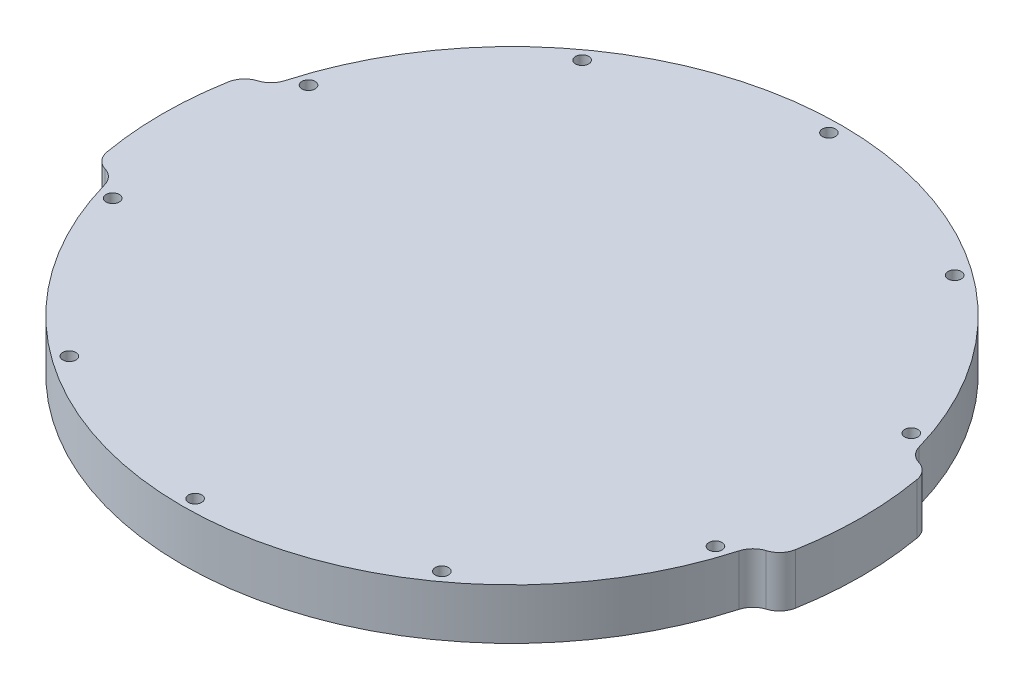
ISO-10303-21;
HEADER;
FILE_DESCRIPTION(('STEP AP214'),'2;1');
FILE_NAME('part.step','',(''),(''),'','','');
FILE_SCHEMA(('AUTOMOTIVE_DESIGN { 1 0 10303 214 1 1 1 1 }'));
ENDSEC;
DATA;
#1=APPLICATION_CONTEXT('core data for automotive mechanical design processes');
#2=APPLICATION_PROTOCOL_DEFINITION('international standard','automotive_design',2000,#1);
#3=PRODUCT_CONTEXT('',#1,'mechanical');
#4=PRODUCT('Part','Part','',(#3));
#5=PRODUCT_RELATED_PRODUCT_CATEGORY('part','',(#4));
#6=PRODUCT_DEFINITION_FORMATION('','',#4);
#7=PRODUCT_DEFINITION_CONTEXT('part definition',#1,'design');
#8=PRODUCT_DEFINITION('design','',#6,#7);
#9=PRODUCT_DEFINITION_SHAPE('','',#8);
#10=(LENGTH_UNIT() NAMED_UNIT(*) SI_UNIT(.MILLI.,.METRE.));
#11=(NAMED_UNIT(*) PLANE_ANGLE_UNIT() SI_UNIT($,.RADIAN.));
#12=(NAMED_UNIT(*) SI_UNIT($,.STERADIAN.) SOLID_ANGLE_UNIT());
#13=UNCERTAINTY_MEASURE_WITH_UNIT(LENGTH_MEASURE(1.E-05),#10,'distance_accuracy_value','');
#14=(GEOMETRIC_REPRESENTATION_CONTEXT(3) GLOBAL_UNCERTAINTY_ASSIGNED_CONTEXT((#13)) GLOBAL_UNIT_ASSIGNED_CONTEXT((#10,
#11,#12)) REPRESENTATION_CONTEXT('',''));
#15=CARTESIAN_POINT('',(0.,0.,0.));
#16=DIRECTION('',(0.,0.,1.));
#17=DIRECTION('',(1.,0.,0.));
#18=AXIS2_PLACEMENT_3D('',#15,#16,#17);
#19=CARTESIAN_POINT('',(-40.6479400055789,12.7,-7.16732853320259));
#20=DIRECTION('',(0.,-1.,0.));
#21=DIRECTION('',(0.,0.,-1.));
#22=AXIS2_PLACEMENT_3D('',#19,#20,#21);
#23=PLANE('',#22);
#24=CARTESIAN_POINT('',(-75.4663345680205,12.7,-24.5204985036521));
#25=DIRECTION('',(0.,1.,0.));
#26=DIRECTION('',(0.,0.,1.));
#27=AXIS2_PLACEMENT_3D('',#24,#25,#26);
#28=CIRCLE('',#27,1.6500000000009);
#29=CARTESIAN_POINT('',(-75.4663345680205,12.7,-22.8704985036512));
#30=VERTEX_POINT('',#29);
#31=EDGE_CURVE('E213',#30,#30,#28,.T.);
#32=ORIENTED_EDGE('',*,*,#31,.F.);
#33=EDGE_LOOP('',(#32));
#34=FACE_BOUND('',#33,.T.);
#35=CARTESIAN_POINT('',(-46.6407597694078,12.7,64.1954985036521));
#36=DIRECTION('',(0.,1.,0.));
#37=DIRECTION('',(0.,0.,1.));
#38=AXIS2_PLACEMENT_3D('',#35,#36,#37);
#39=CIRCLE('',#38,1.65000000000068);
#40=CARTESIAN_POINT('',(-46.6407597694078,12.7,65.8454985036528));
#41=VERTEX_POINT('',#40);
#42=EDGE_CURVE('E236',#41,#41,#39,.T.);
#43=ORIENTED_EDGE('',*,*,#42,.F.);
#44=EDGE_LOOP('',(#43));
#45=FACE_BOUND('',#44,.T.);
#46=CARTESIAN_POINT('',(46.6407597694077,12.7,64.1954985036521));
#47=DIRECTION('',(0.,1.,0.));
#48=DIRECTION('',(0.,0.,1.));
#49=AXIS2_PLACEMENT_3D('',#46,#47,#48);
#50=CIRCLE('',#49,1.65000000000041);
#51=CARTESIAN_POINT('',(46.6407597694077,12.7,65.8454985036525));
#52=VERTEX_POINT('',#51);
#53=EDGE_CURVE('E252',#52,#52,#50,.T.);
#54=ORIENTED_EDGE('',*,*,#53,.F.);
#55=EDGE_LOOP('',(#54));
#56=FACE_BOUND('',#55,.T.);
#57=CARTESIAN_POINT('',(75.4663345680204,12.7,-24.5204985036521));
#58=DIRECTION('',(0.,1.,0.));
#59=DIRECTION('',(0.,0.,1.));
#60=AXIS2_PLACEMENT_3D('',#57,#58,#59);
#61=CIRCLE('',#60,1.65000000000021);
#62=CARTESIAN_POINT('',(75.4663345680204,12.7,-22.8704985036519));
#63=VERTEX_POINT('',#62);
#64=EDGE_CURVE('E268',#63,#63,#61,.T.);
#65=ORIENTED_EDGE('',*,*,#64,.F.);
#66=EDGE_LOOP('',(#65));
#67=FACE_BOUND('',#66,.T.);
#68=CARTESIAN_POINT('',(0.,12.7,-79.35));
#69=DIRECTION('',(0.,1.,0.));
#70=DIRECTION('',(0.,0.,1.));
#71=AXIS2_PLACEMENT_3D('',#68,#69,#70);
#72=CIRCLE('',#71,1.65);
#73=CARTESIAN_POINT('',(0.,12.7,-77.7));
#74=VERTEX_POINT('',#73);
#75=EDGE_CURVE('E284',#74,#74,#72,.T.);
#76=ORIENTED_EDGE('',*,*,#75,.F.);
#77=EDGE_LOOP('',(#76));
#78=FACE_BOUND('',#77,.T.);
#79=CARTESIAN_POINT('',(0.,12.7,0.));
#80=DIRECTION('',(0.,1.,0.));
#81=DIRECTION('',(0.,0.,-1.));
#82=AXIS2_PLACEMENT_3D('',#79,#80,#81);
#83=CIRCLE('',#82,82.55);
#84=CARTESIAN_POINT('',(79.4156922102393,12.7,-22.5310969721527));
#85=VERTEX_POINT('',#84);
#86=CARTESIAN_POINT('',(-79.4156922102391,12.7,-22.531096972153));
#87=VERTEX_POINT('',#86);
#88=EDGE_CURVE('E307',#85,#87,#83,.T.);
#89=ORIENTED_EDGE('',*,*,#88,.T.);
#90=CARTESIAN_POINT('',(-84.2258492187333,12.7,-23.8957909135312));
#91=DIRECTION('',(0.,-1.,0.));
#92=DIRECTION('',(0.,0.,-1.));
#93=AXIS2_PLACEMENT_3D('',#90,#91,#92);
#94=CIRCLE('',#93,5.);
#95=CARTESIAN_POINT('',(-82.7608646149456,12.7,-19.1152239899681));
#96=VERTEX_POINT('',#95);
#97=EDGE_CURVE('E137',#87,#96,#94,.T.);
#98=ORIENTED_EDGE('',*,*,#97,.T.);
#99=CARTESIAN_POINT('',(-81.2958800111578,12.7,-14.3346570664051));
#100=DIRECTION('',(0.,1.,0.));
#101=DIRECTION('',(0.,0.,-1.));
#102=AXIS2_PLACEMENT_3D('',#99,#100,#101);
#103=CIRCLE('',#102,5.00000000000001);
#104=CARTESIAN_POINT('',(-86.2199187762188,12.7,-15.2028979547397));
#105=VERTEX_POINT('',#104);
#106=EDGE_CURVE('E130',#96,#105,#103,.T.);
#107=ORIENTED_EDGE('',*,*,#106,.T.);
#108=CARTESIAN_POINT('',(0.,12.7,0.));
#109=DIRECTION('',(0.,1.,0.));
#110=DIRECTION('',(0.,0.,-1.));
#111=AXIS2_PLACEMENT_3D('',#108,#109,#110);
#112=CIRCLE('',#111,87.55);
#113=CARTESIAN_POINT('',(-86.2199187762188,12.7,15.2028979547398));
#114=VERTEX_POINT('',#113);
#115=EDGE_CURVE('E134',#105,#114,#112,.T.);
#116=ORIENTED_EDGE('',*,*,#115,.T.);
#117=CARTESIAN_POINT('',(-81.2958800111578,12.7,14.3346570664051));
#118=DIRECTION('',(0.,1.,0.));
#119=DIRECTION('',(0.,0.,1.));
#120=AXIS2_PLACEMENT_3D('',#117,#118,#119);
#121=CIRCLE('',#120,5.00000000000001);
#122=CARTESIAN_POINT('',(-82.7608646149455,12.7,19.1152239899681));
#123=VERTEX_POINT('',#122);
#124=EDGE_CURVE('E152',#114,#123,#121,.T.);
#125=ORIENTED_EDGE('',*,*,#124,.T.);
#126=CARTESIAN_POINT('',(-84.2258492187333,12.7,23.8957909135312));
#127=DIRECTION('',(0.,-1.,0.));
#128=DIRECTION('',(0.,0.,-1.));
#129=AXIS2_PLACEMENT_3D('',#126,#127,#128);
#130=CIRCLE('',#129,5.);
#131=CARTESIAN_POINT('',(-79.4156922102391,12.7,22.531096972153));
#132=VERTEX_POINT('',#131);
#133=EDGE_CURVE('E11',#123,#132,#130,.T.);
#134=ORIENTED_EDGE('',*,*,#133,.T.);
#135=CARTESIAN_POINT('',(0.,12.7,-4.92661467177413E-13));
#136=DIRECTION('',(0.,1.,0.));
#137=DIRECTION('',(0.,0.,-1.));
#138=AXIS2_PLACEMENT_3D('',#135,#136,#137);
#139=CIRCLE('',#138,82.5500000000001);
#140=CARTESIAN_POINT('',(79.4156922102392,12.7,22.5310969721527));
#141=VERTEX_POINT('',#140);
#142=EDGE_CURVE('E293',#132,#141,#139,.T.);
#143=ORIENTED_EDGE('',*,*,#142,.T.);
#144=CARTESIAN_POINT('',(84.2258492187334,12.7,23.8957909135309));
#145=DIRECTION('',(0.,-1.,0.));
#146=DIRECTION('',(0.,0.,-1.));
#147=AXIS2_PLACEMENT_3D('',#144,#145,#146);
#148=CIRCLE('',#147,5.);
#149=CARTESIAN_POINT('',(82.7608646149456,12.7,19.1152239899679));
#150=VERTEX_POINT('',#149);
#151=EDGE_CURVE('E195',#141,#150,#148,.T.);
#152=ORIENTED_EDGE('',*,*,#151,.T.);
#153=CARTESIAN_POINT('',(81.2958800111578,12.7,14.3346570664051));
#154=DIRECTION('',(0.,1.,0.));
#155=DIRECTION('',(0.,0.,-1.));
#156=AXIS2_PLACEMENT_3D('',#153,#154,#155);
#157=CIRCLE('',#156,4.99999999999974);
#158=CARTESIAN_POINT('',(86.2199187762186,12.7,15.2028979547397));
#159=VERTEX_POINT('',#158);
#160=EDGE_CURVE('E297',#150,#159,#157,.T.);
#161=ORIENTED_EDGE('',*,*,#160,.T.);
#162=CARTESIAN_POINT('',(-1.29063426612674E-12,12.7,0.));
#163=DIRECTION('',(0.,1.,0.));
#164=DIRECTION('',(0.,0.,1.));
#165=AXIS2_PLACEMENT_3D('',#162,#163,#164);
#166=CIRCLE('',#165,87.550000000001);
#167=CARTESIAN_POINT('',(86.2199187762185,12.7,-15.2028979547397));
#168=VERTEX_POINT('',#167);
#169=EDGE_CURVE('E300',#159,#168,#166,.T.);
#170=ORIENTED_EDGE('',*,*,#169,.T.);
#171=CARTESIAN_POINT('',(81.2958800111578,12.7,-14.3346570664051));
#172=DIRECTION('',(0.,1.,0.));
#173=DIRECTION('',(0.,0.,1.));
#174=AXIS2_PLACEMENT_3D('',#171,#172,#173);
#175=CIRCLE('',#174,4.99999999999974);
#176=CARTESIAN_POINT('',(82.7608646149456,12.7,-19.1152239899679));
#177=VERTEX_POINT('',#176);
#178=EDGE_CURVE('E303',#168,#177,#175,.T.);
#179=ORIENTED_EDGE('',*,*,#178,.T.);
#180=CARTESIAN_POINT('',(84.2258492187335,12.7,-23.8957909135308));
#181=DIRECTION('',(0.,-1.,0.));
#182=DIRECTION('',(0.,0.,-1.));
#183=AXIS2_PLACEMENT_3D('',#180,#181,#182);
#184=CIRCLE('',#183,5.);
#185=EDGE_CURVE('E201',#177,#85,#184,.T.);
#186=ORIENTED_EDGE('',*,*,#185,.T.);
#187=EDGE_LOOP('',(#89,#98,#107,#116,#125,#134,#143,#152,#161,#170,#179,#186));
#188=FACE_BOUND('',#187,.T.);
#189=CARTESIAN_POINT('',(46.6407597694078,12.7,-64.1954985036521));
#190=DIRECTION('',(0.,1.,0.));
#191=DIRECTION('',(0.,0.,1.));
#192=AXIS2_PLACEMENT_3D('',#189,#190,#191);
#193=CIRCLE('',#192,1.65000000000012);
#194=CARTESIAN_POINT('',(46.6407597694078,12.7,-62.5454985036519));
#195=VERTEX_POINT('',#194);
#196=EDGE_CURVE('E276',#195,#195,#193,.T.);
#197=ORIENTED_EDGE('',*,*,#196,.F.);
#198=EDGE_LOOP('',(#197));
#199=FACE_BOUND('',#198,.T.);
#200=CARTESIAN_POINT('',(75.4663345680204,12.7,24.5204985036521));
#201=DIRECTION('',(0.,1.,0.));
#202=DIRECTION('',(0.,0.,1.));
#203=AXIS2_PLACEMENT_3D('',#200,#201,#202);
#204=CIRCLE('',#203,1.65000000000032);
#205=CARTESIAN_POINT('',(75.4663345680204,12.7,26.1704985036524));
#206=VERTEX_POINT('',#205);
#207=EDGE_CURVE('E260',#206,#206,#204,.T.);
#208=ORIENTED_EDGE('',*,*,#207,.F.);
#209=EDGE_LOOP('',(#208));
#210=FACE_BOUND('',#209,.T.);
#211=CARTESIAN_POINT('',(0.,12.7,79.35));
#212=DIRECTION('',(0.,1.,0.));
#213=DIRECTION('',(0.,0.,1.));
#214=AXIS2_PLACEMENT_3D('',#211,#212,#213);
#215=CIRCLE('',#214,1.65000000000052);
#216=CARTESIAN_POINT('',(0.,12.7,81.0000000000005));
#217=VERTEX_POINT('',#216);
#218=EDGE_CURVE('E244',#217,#217,#215,.T.);
#219=ORIENTED_EDGE('',*,*,#218,.F.);
#220=EDGE_LOOP('',(#219));
#221=FACE_BOUND('',#220,.T.);
#222=CARTESIAN_POINT('',(-75.4663345680204,12.7,24.5204985036521));
#223=DIRECTION('',(0.,1.,0.));
#224=DIRECTION('',(0.,0.,1.));
#225=AXIS2_PLACEMENT_3D('',#222,#223,#224);
#226=CIRCLE('',#225,1.65000000000073);
#227=CARTESIAN_POINT('',(-75.4663345680204,12.7,26.1704985036528));
#228=VERTEX_POINT('',#227);
#229=EDGE_CURVE('E228',#228,#228,#226,.T.);
#230=ORIENTED_EDGE('',*,*,#229,.F.);
#231=EDGE_LOOP('',(#230));
#232=FACE_BOUND('',#231,.T.);
#233=CARTESIAN_POINT('',(-46.6407597694078,12.7,-64.1954985036521));
#234=DIRECTION('',(0.,1.,0.));
#235=DIRECTION('',(0.,0.,1.));
#236=AXIS2_PLACEMENT_3D('',#233,#234,#235);
#237=CIRCLE('',#236,1.65000000000102);
#238=CARTESIAN_POINT('',(-46.6407597694078,12.7,-62.545498503651));
#239=VERTEX_POINT('',#238);
#240=EDGE_CURVE('E214',#239,#239,#237,.T.);
#241=ORIENTED_EDGE('',*,*,#240,.F.);
#242=EDGE_LOOP('',(#241));
#243=FACE_BOUND('',#242,.T.);
#244=ADVANCED_FACE('F41',(#34,#45,#56,#67,#78,#188,#199,#210,#221,#232,#243),#23,.F.);
#245=CARTESIAN_POINT('',(-40.6479400055789,0.,-7.16732853320259));
#246=DIRECTION('',(0.,-1.,0.));
#247=DIRECTION('',(0.,0.,-1.));
#248=AXIS2_PLACEMENT_3D('',#245,#246,#247);
#249=PLANE('',#248);
#250=CARTESIAN_POINT('',(-75.4663345680205,0.,-24.5204985036521));
#251=DIRECTION('',(0.,1.,0.));
#252=DIRECTION('',(0.,0.,1.));
#253=AXIS2_PLACEMENT_3D('',#250,#251,#252);
#254=CIRCLE('',#253,1.6500000000009);
#255=CARTESIAN_POINT('',(-75.4663345680205,0.,-22.8704985036512));
#256=VERTEX_POINT('',#255);
#257=EDGE_CURVE('E211',#256,#256,#254,.T.);
#258=ORIENTED_EDGE('',*,*,#257,.T.);
#259=EDGE_LOOP('',(#258));
#260=FACE_BOUND('',#259,.T.);
#261=CARTESIAN_POINT('',(-46.6407597694078,0.,64.1954985036521));
#262=DIRECTION('',(0.,1.,0.));
#263=DIRECTION('',(0.,0.,1.));
#264=AXIS2_PLACEMENT_3D('',#261,#262,#263);
#265=CIRCLE('',#264,1.65000000000068);
#266=CARTESIAN_POINT('',(-46.6407597694078,0.,65.8454985036528));
#267=VERTEX_POINT('',#266);
#268=EDGE_CURVE('E232',#267,#267,#265,.T.);
#269=ORIENTED_EDGE('',*,*,#268,.T.);
#270=EDGE_LOOP('',(#269));
#271=FACE_BOUND('',#270,.T.);
#272=CARTESIAN_POINT('',(46.6407597694077,0.,64.1954985036521));
#273=DIRECTION('',(0.,1.,0.));
#274=DIRECTION('',(0.,0.,1.));
#275=AXIS2_PLACEMENT_3D('',#272,#273,#274);
#276=CIRCLE('',#275,1.65000000000041);
#277=CARTESIAN_POINT('',(46.6407597694077,0.,65.8454985036525));
#278=VERTEX_POINT('',#277);
#279=EDGE_CURVE('E248',#278,#278,#276,.T.);
#280=ORIENTED_EDGE('',*,*,#279,.T.);
#281=EDGE_LOOP('',(#280));
#282=FACE_BOUND('',#281,.T.);
#283=CARTESIAN_POINT('',(75.4663345680204,0.,-24.5204985036521));
#284=DIRECTION('',(0.,1.,0.));
#285=DIRECTION('',(0.,0.,1.));
#286=AXIS2_PLACEMENT_3D('',#283,#284,#285);
#287=CIRCLE('',#286,1.65000000000021);
#288=CARTESIAN_POINT('',(75.4663345680204,0.,-22.8704985036519));
#289=VERTEX_POINT('',#288);
#290=EDGE_CURVE('E264',#289,#289,#287,.T.);
#291=ORIENTED_EDGE('',*,*,#290,.T.);
#292=EDGE_LOOP('',(#291));
#293=FACE_BOUND('',#292,.T.);
#294=CARTESIAN_POINT('',(0.,0.,-79.35));
#295=DIRECTION('',(0.,1.,0.));
#296=DIRECTION('',(0.,0.,1.));
#297=AXIS2_PLACEMENT_3D('',#294,#295,#296);
#298=CIRCLE('',#297,1.65);
#299=CARTESIAN_POINT('',(0.,0.,-77.7));
#300=VERTEX_POINT('',#299);
#301=EDGE_CURVE('E280',#300,#300,#298,.T.);
#302=ORIENTED_EDGE('',*,*,#301,.T.);
#303=EDGE_LOOP('',(#302));
#304=FACE_BOUND('',#303,.T.);
#305=CARTESIAN_POINT('',(-81.2958800111578,0.,-14.3346570664051));
#306=DIRECTION('',(0.,1.,0.));
#307=DIRECTION('',(0.,0.,-1.));
#308=AXIS2_PLACEMENT_3D('',#305,#306,#307);
#309=CIRCLE('',#308,5.00000000000001);
#310=CARTESIAN_POINT('',(-82.7608646149456,0.,-19.1152239899681));
#311=VERTEX_POINT('',#310);
#312=CARTESIAN_POINT('',(-86.2199187762188,0.,-15.2028979547397));
#313=VERTEX_POINT('',#312);
#314=EDGE_CURVE('E156',#311,#313,#309,.T.);
#315=ORIENTED_EDGE('',*,*,#314,.F.);
#316=CARTESIAN_POINT('',(-84.2258492187333,0.,-23.8957909135312));
#317=DIRECTION('',(0.,-1.,0.));
#318=DIRECTION('',(0.,0.,-1.));
#319=AXIS2_PLACEMENT_3D('',#316,#317,#318);
#320=CIRCLE('',#319,5.);
#321=CARTESIAN_POINT('',(-79.4156922102391,0.,-22.531096972153));
#322=VERTEX_POINT('',#321);
#323=EDGE_CURVE('E204',#311,#322,#320,.F.);
#324=ORIENTED_EDGE('',*,*,#323,.T.);
#325=CARTESIAN_POINT('',(0.,0.,0.));
#326=DIRECTION('',(0.,1.,0.));
#327=DIRECTION('',(0.,0.,-1.));
#328=AXIS2_PLACEMENT_3D('',#325,#326,#327);
#329=CIRCLE('',#328,82.55);
#330=CARTESIAN_POINT('',(79.4156922102393,0.,-22.5310969721527));
#331=VERTEX_POINT('',#330);
#332=EDGE_CURVE('E143',#331,#322,#329,.T.);
#333=ORIENTED_EDGE('',*,*,#332,.F.);
#334=CARTESIAN_POINT('',(84.2258492187335,0.,-23.8957909135308));
#335=DIRECTION('',(0.,-1.,0.));
#336=DIRECTION('',(0.,0.,-1.));
#337=AXIS2_PLACEMENT_3D('',#334,#335,#336);
#338=CIRCLE('',#337,5.);
#339=CARTESIAN_POINT('',(82.7608646149456,0.,-19.1152239899679));
#340=VERTEX_POINT('',#339);
#341=EDGE_CURVE('E198',#331,#340,#338,.F.);
#342=ORIENTED_EDGE('',*,*,#341,.T.);
#343=CARTESIAN_POINT('',(81.2958800111578,0.,-14.3346570664051));
#344=DIRECTION('',(0.,1.,0.));
#345=DIRECTION('',(0.,0.,1.));
#346=AXIS2_PLACEMENT_3D('',#343,#344,#345);
#347=CIRCLE('',#346,4.99999999999974);
#348=CARTESIAN_POINT('',(86.2199187762185,0.,-15.2028979547397));
#349=VERTEX_POINT('',#348);
#350=EDGE_CURVE('E328',#349,#340,#347,.T.);
#351=ORIENTED_EDGE('',*,*,#350,.F.);
#352=CARTESIAN_POINT('',(-1.29063426612674E-12,0.,0.));
#353=DIRECTION('',(0.,1.,0.));
#354=DIRECTION('',(0.,0.,1.));
#355=AXIS2_PLACEMENT_3D('',#352,#353,#354);
#356=CIRCLE('',#355,87.550000000001);
#357=CARTESIAN_POINT('',(86.2199187762186,0.,15.2028979547397));
#358=VERTEX_POINT('',#357);
#359=EDGE_CURVE('E325',#358,#349,#356,.T.);
#360=ORIENTED_EDGE('',*,*,#359,.F.);
#361=CARTESIAN_POINT('',(81.2958800111578,0.,14.3346570664051));
#362=DIRECTION('',(0.,1.,0.));
#363=DIRECTION('',(0.,0.,-1.));
#364=AXIS2_PLACEMENT_3D('',#361,#362,#363);
#365=CIRCLE('',#364,4.99999999999974);
#366=CARTESIAN_POINT('',(82.7608646149456,0.,19.1152239899679));
#367=VERTEX_POINT('',#366);
#368=EDGE_CURVE('E322',#367,#358,#365,.T.);
#369=ORIENTED_EDGE('',*,*,#368,.F.);
#370=CARTESIAN_POINT('',(84.2258492187334,0.,23.8957909135309));
#371=DIRECTION('',(0.,-1.,0.));
#372=DIRECTION('',(0.,0.,-1.));
#373=AXIS2_PLACEMENT_3D('',#370,#371,#372);
#374=CIRCLE('',#373,5.);
#375=CARTESIAN_POINT('',(79.4156922102392,0.,22.5310969721527));
#376=VERTEX_POINT('',#375);
#377=EDGE_CURVE('E192',#367,#376,#374,.F.);
#378=ORIENTED_EDGE('',*,*,#377,.T.);
#379=CARTESIAN_POINT('',(0.,0.,-4.92661467177413E-13));
#380=DIRECTION('',(0.,1.,0.));
#381=DIRECTION('',(0.,0.,-1.));
#382=AXIS2_PLACEMENT_3D('',#379,#380,#381);
#383=CIRCLE('',#382,82.5500000000001);
#384=CARTESIAN_POINT('',(-79.4156922102391,0.,22.531096972153));
#385=VERTEX_POINT('',#384);
#386=EDGE_CURVE('E318',#385,#376,#383,.T.);
#387=ORIENTED_EDGE('',*,*,#386,.F.);
#388=CARTESIAN_POINT('',(-84.2258492187333,0.,23.8957909135312));
#389=DIRECTION('',(0.,-1.,0.));
#390=DIRECTION('',(0.,0.,-1.));
#391=AXIS2_PLACEMENT_3D('',#388,#389,#390);
#392=CIRCLE('',#391,5.);
#393=CARTESIAN_POINT('',(-82.7608646149455,0.,19.1152239899681));
#394=VERTEX_POINT('',#393);
#395=EDGE_CURVE('E50',#385,#394,#392,.F.);
#396=ORIENTED_EDGE('',*,*,#395,.T.);
#397=CARTESIAN_POINT('',(-81.2958800111578,0.,14.3346570664051));
#398=DIRECTION('',(0.,1.,0.));
#399=DIRECTION('',(0.,0.,1.));
#400=AXIS2_PLACEMENT_3D('',#397,#398,#399);
#401=CIRCLE('',#400,5.00000000000001);
#402=CARTESIAN_POINT('',(-86.2199187762188,0.,15.2028979547398));
#403=VERTEX_POINT('',#402);
#404=EDGE_CURVE('E315',#403,#394,#401,.T.);
#405=ORIENTED_EDGE('',*,*,#404,.F.);
#406=CARTESIAN_POINT('',(0.,0.,0.));
#407=DIRECTION('',(0.,1.,0.));
#408=DIRECTION('',(0.,0.,-1.));
#409=AXIS2_PLACEMENT_3D('',#406,#407,#408);
#410=CIRCLE('',#409,87.55);
#411=EDGE_CURVE('E312',#313,#403,#410,.T.);
#412=ORIENTED_EDGE('',*,*,#411,.F.);
#413=EDGE_LOOP('',(#315,#324,#333,#342,#351,#360,#369,#378,#387,#396,#405,#412));
#414=FACE_BOUND('',#413,.T.);
#415=CARTESIAN_POINT('',(46.6407597694078,0.,-64.1954985036521));
#416=DIRECTION('',(0.,1.,0.));
#417=DIRECTION('',(0.,0.,1.));
#418=AXIS2_PLACEMENT_3D('',#415,#416,#417);
#419=CIRCLE('',#418,1.65000000000012);
#420=CARTESIAN_POINT('',(46.6407597694078,0.,-62.5454985036519));
#421=VERTEX_POINT('',#420);
#422=EDGE_CURVE('E272',#421,#421,#419,.T.);
#423=ORIENTED_EDGE('',*,*,#422,.T.);
#424=EDGE_LOOP('',(#423));
#425=FACE_BOUND('',#424,.T.);
#426=CARTESIAN_POINT('',(75.4663345680204,0.,24.5204985036521));
#427=DIRECTION('',(0.,1.,0.));
#428=DIRECTION('',(0.,0.,1.));
#429=AXIS2_PLACEMENT_3D('',#426,#427,#428);
#430=CIRCLE('',#429,1.65000000000032);
#431=CARTESIAN_POINT('',(75.4663345680204,0.,26.1704985036524));
#432=VERTEX_POINT('',#431);
#433=EDGE_CURVE('E256',#432,#432,#430,.T.);
#434=ORIENTED_EDGE('',*,*,#433,.T.);
#435=EDGE_LOOP('',(#434));
#436=FACE_BOUND('',#435,.T.);
#437=CARTESIAN_POINT('',(0.,0.,79.35));
#438=DIRECTION('',(0.,1.,0.));
#439=DIRECTION('',(0.,0.,1.));
#440=AXIS2_PLACEMENT_3D('',#437,#438,#439);
#441=CIRCLE('',#440,1.65000000000052);
#442=CARTESIAN_POINT('',(0.,0.,81.0000000000005));
#443=VERTEX_POINT('',#442);
#444=EDGE_CURVE('E240',#443,#443,#441,.T.);
#445=ORIENTED_EDGE('',*,*,#444,.T.);
#446=EDGE_LOOP('',(#445));
#447=FACE_BOUND('',#446,.T.);
#448=CARTESIAN_POINT('',(-75.4663345680204,0.,24.5204985036521));
#449=DIRECTION('',(0.,1.,0.));
#450=DIRECTION('',(0.,0.,1.));
#451=AXIS2_PLACEMENT_3D('',#448,#449,#450);
#452=CIRCLE('',#451,1.65000000000073);
#453=CARTESIAN_POINT('',(-75.4663345680204,0.,26.1704985036528));
#454=VERTEX_POINT('',#453);
#455=EDGE_CURVE('E220',#454,#454,#452,.T.);
#456=ORIENTED_EDGE('',*,*,#455,.T.);
#457=EDGE_LOOP('',(#456));
#458=FACE_BOUND('',#457,.T.);
#459=CARTESIAN_POINT('',(-46.6407597694078,0.,-64.1954985036521));
#460=DIRECTION('',(0.,1.,0.));
#461=DIRECTION('',(0.,0.,1.));
#462=AXIS2_PLACEMENT_3D('',#459,#460,#461);
#463=CIRCLE('',#462,1.65000000000102);
#464=CARTESIAN_POINT('',(-46.6407597694078,0.,-62.545498503651));
#465=VERTEX_POINT('',#464);
#466=EDGE_CURVE('E224',#465,#465,#463,.T.);
#467=ORIENTED_EDGE('',*,*,#466,.T.);
#468=EDGE_LOOP('',(#467));
#469=FACE_BOUND('',#468,.T.);
#470=ADVANCED_FACE('F348',(#260,#271,#282,#293,#304,#414,#425,#436,#447,#458,#469),#249,.T.);
#471=CARTESIAN_POINT('',(-81.2958800111578,12.7,-14.3346570664051));
#472=DIRECTION('',(0.,-1.,0.));
#473=DIRECTION('',(0.,0.,-1.));
#474=AXIS2_PLACEMENT_3D('',#471,#472,#473);
#475=CYLINDRICAL_SURFACE('',#474,5.00000000000001);
#476=ORIENTED_EDGE('',*,*,#106,.F.);
#477=DIRECTION('',(0.,-1.,0.));
#478=VECTOR('',#477,1.);
#479=CARTESIAN_POINT('',(-82.7608646149456,12.7,-19.1152239899681));
#480=LINE('',#479,#478);
#481=EDGE_CURVE('E187',#96,#311,#480,.T.);
#482=ORIENTED_EDGE('',*,*,#481,.T.);
#483=ORIENTED_EDGE('',*,*,#314,.T.);
#484=DIRECTION('',(0.,-1.,0.));
#485=VECTOR('',#484,1.);
#486=CARTESIAN_POINT('',(-86.2199187762188,12.7,-15.2028979547397));
#487=LINE('',#486,#485);
#488=EDGE_CURVE('E148',#105,#313,#487,.T.);
#489=ORIENTED_EDGE('',*,*,#488,.F.);
#490=EDGE_LOOP('',(#476,#482,#483,#489));
#491=FACE_BOUND('',#490,.T.);
#492=ADVANCED_FACE('F154',(#491),#475,.T.);
#493=CARTESIAN_POINT('',(0.,12.7,0.));
#494=DIRECTION('',(0.,-1.,0.));
#495=DIRECTION('',(0.,0.,-1.));
#496=AXIS2_PLACEMENT_3D('',#493,#494,#495);
#497=CYLINDRICAL_SURFACE('',#496,87.55);
#498=ORIENTED_EDGE('',*,*,#411,.T.);
#499=DIRECTION('',(0.,-1.,0.));
#500=VECTOR('',#499,1.);
#501=CARTESIAN_POINT('',(-86.2199187762188,12.7,15.2028979547398));
#502=LINE('',#501,#500);
#503=EDGE_CURVE('E150',#114,#403,#502,.T.);
#504=ORIENTED_EDGE('',*,*,#503,.F.);
#505=ORIENTED_EDGE('',*,*,#115,.F.);
#506=ORIENTED_EDGE('',*,*,#488,.T.);
#507=EDGE_LOOP('',(#498,#504,#505,#506));
#508=FACE_BOUND('',#507,.T.);
#509=ADVANCED_FACE('F147',(#508),#497,.T.);
#510=CARTESIAN_POINT('',(-81.2958800111578,12.7,14.3346570664051));
#511=DIRECTION('',(0.,-1.,0.));
#512=DIRECTION('',(0.,0.,-1.));
#513=AXIS2_PLACEMENT_3D('',#510,#511,#512);
#514=CYLINDRICAL_SURFACE('',#513,5.00000000000001);
#515=ORIENTED_EDGE('',*,*,#404,.T.);
#516=DIRECTION('',(0.,-1.,0.));
#517=VECTOR('',#516,1.);
#518=CARTESIAN_POINT('',(-82.7608646149455,12.7,19.1152239899681));
#519=LINE('',#518,#517);
#520=EDGE_CURVE('E57',#394,#123,#519,.F.);
#521=ORIENTED_EDGE('',*,*,#520,.T.);
#522=ORIENTED_EDGE('',*,*,#124,.F.);
#523=ORIENTED_EDGE('',*,*,#503,.T.);
#524=EDGE_LOOP('',(#515,#521,#522,#523));
#525=FACE_BOUND('',#524,.T.);
#526=ADVANCED_FACE('F365',(#525),#514,.T.);
#527=CARTESIAN_POINT('',(0.,12.7,-4.92661467177413E-13));
#528=DIRECTION('',(0.,-1.,0.));
#529=DIRECTION('',(0.,0.,-1.));
#530=AXIS2_PLACEMENT_3D('',#527,#528,#529);
#531=CYLINDRICAL_SURFACE('',#530,82.5500000000001);
#532=ORIENTED_EDGE('',*,*,#386,.T.);
#533=DIRECTION('',(0.,-1.,0.));
#534=VECTOR('',#533,1.);
#535=CARTESIAN_POINT('',(79.4156922102392,12.7,22.5310969721527));
#536=LINE('',#535,#534);
#537=EDGE_CURVE('E174',#376,#141,#536,.F.);
#538=ORIENTED_EDGE('',*,*,#537,.T.);
#539=ORIENTED_EDGE('',*,*,#142,.F.);
#540=DIRECTION('',(0.,-1.,0.));
#541=VECTOR('',#540,1.);
#542=CARTESIAN_POINT('',(-79.4156922102391,12.7,22.531096972153));
#543=LINE('',#542,#541);
#544=EDGE_CURVE('E164',#132,#385,#543,.T.);
#545=ORIENTED_EDGE('',*,*,#544,.T.);
#546=EDGE_LOOP('',(#532,#538,#539,#545));
#547=FACE_BOUND('',#546,.T.);
#548=ADVANCED_FACE('F371',(#547),#531,.T.);
#549=CARTESIAN_POINT('',(81.2958800111578,12.7,14.3346570664051));
#550=DIRECTION('',(0.,-1.,0.));
#551=DIRECTION('',(0.,0.,-1.));
#552=AXIS2_PLACEMENT_3D('',#549,#550,#551);
#553=CYLINDRICAL_SURFACE('',#552,4.99999999999974);
#554=ORIENTED_EDGE('',*,*,#160,.F.);
#555=DIRECTION('',(0.,-1.,0.));
#556=VECTOR('',#555,1.);
#557=CARTESIAN_POINT('',(82.7608646149456,12.7,19.1152239899679));
#558=LINE('',#557,#556);
#559=EDGE_CURVE('E159',#150,#367,#558,.T.);
#560=ORIENTED_EDGE('',*,*,#559,.T.);
#561=ORIENTED_EDGE('',*,*,#368,.T.);
#562=DIRECTION('',(0.,-1.,0.));
#563=VECTOR('',#562,1.);
#564=CARTESIAN_POINT('',(86.2199187762186,12.7,15.2028979547397));
#565=LINE('',#564,#563);
#566=EDGE_CURVE('E167',#159,#358,#565,.T.);
#567=ORIENTED_EDGE('',*,*,#566,.F.);
#568=EDGE_LOOP('',(#554,#560,#561,#567));
#569=FACE_BOUND('',#568,.T.);
#570=ADVANCED_FACE('F377',(#569),#553,.T.);
#571=CARTESIAN_POINT('',(-1.29063426612674E-12,12.7,0.));
#572=DIRECTION('',(0.,-1.,0.));
#573=DIRECTION('',(0.,0.,-1.));
#574=AXIS2_PLACEMENT_3D('',#571,#572,#573);
#575=CYLINDRICAL_SURFACE('',#574,87.550000000001);
#576=ORIENTED_EDGE('',*,*,#359,.T.);
#577=DIRECTION('',(0.,-1.,0.));
#578=VECTOR('',#577,1.);
#579=CARTESIAN_POINT('',(86.2199187762185,12.7,-15.2028979547397));
#580=LINE('',#579,#578);
#581=EDGE_CURVE('E310',#168,#349,#580,.T.);
#582=ORIENTED_EDGE('',*,*,#581,.F.);
#583=ORIENTED_EDGE('',*,*,#169,.F.);
#584=ORIENTED_EDGE('',*,*,#566,.T.);
#585=EDGE_LOOP('',(#576,#582,#583,#584));
#586=FACE_BOUND('',#585,.T.);
#587=ADVANCED_FACE('F342',(#586),#575,.T.);
#588=CARTESIAN_POINT('',(81.2958800111578,12.7,-14.3346570664051));
#589=DIRECTION('',(0.,-1.,0.));
#590=DIRECTION('',(0.,0.,-1.));
#591=AXIS2_PLACEMENT_3D('',#588,#589,#590);
#592=CYLINDRICAL_SURFACE('',#591,4.99999999999974);
#593=ORIENTED_EDGE('',*,*,#350,.T.);
#594=DIRECTION('',(0.,-1.,0.));
#595=VECTOR('',#594,1.);
#596=CARTESIAN_POINT('',(82.7608646149456,12.7,-19.1152239899679));
#597=LINE('',#596,#595);
#598=EDGE_CURVE('E184',#340,#177,#597,.F.);
#599=ORIENTED_EDGE('',*,*,#598,.T.);
#600=ORIENTED_EDGE('',*,*,#178,.F.);
#601=ORIENTED_EDGE('',*,*,#581,.T.);
#602=EDGE_LOOP('',(#593,#599,#600,#601));
#603=FACE_BOUND('',#602,.T.);
#604=ADVANCED_FACE('F353',(#603),#592,.T.);
#605=CARTESIAN_POINT('',(0.,12.7,0.));
#606=DIRECTION('',(0.,-1.,0.));
#607=DIRECTION('',(0.,0.,-1.));
#608=AXIS2_PLACEMENT_3D('',#605,#606,#607);
#609=CYLINDRICAL_SURFACE('',#608,82.55);
#610=ORIENTED_EDGE('',*,*,#88,.F.);
#611=DIRECTION('',(0.,-1.,0.));
#612=VECTOR('',#611,1.);
#613=CARTESIAN_POINT('',(79.4156922102393,12.7,-22.5310969721527));
#614=LINE('',#613,#612);
#615=EDGE_CURVE('E180',#85,#331,#614,.T.);
#616=ORIENTED_EDGE('',*,*,#615,.T.);
#617=ORIENTED_EDGE('',*,*,#332,.T.);
#618=DIRECTION('',(0.,-1.,0.));
#619=VECTOR('',#618,1.);
#620=CARTESIAN_POINT('',(-79.4156922102391,12.7,-22.531096972153));
#621=LINE('',#620,#619);
#622=EDGE_CURVE('E177',#322,#87,#621,.F.);
#623=ORIENTED_EDGE('',*,*,#622,.T.);
#624=EDGE_LOOP('',(#610,#616,#617,#623));
#625=FACE_BOUND('',#624,.T.);
#626=ADVANCED_FACE('F361',(#625),#609,.T.);
#627=CARTESIAN_POINT('',(0.,12.7,-79.35));
#628=DIRECTION('',(0.,-1.,0.));
#629=DIRECTION('',(0.,0.,-1.));
#630=AXIS2_PLACEMENT_3D('',#627,#628,#629);
#631=CYLINDRICAL_SURFACE('',#630,1.65);
#632=ORIENTED_EDGE('',*,*,#75,.T.);
#633=EDGE_LOOP('',(#632));
#634=FACE_BOUND('',#633,.T.);
#635=ORIENTED_EDGE('',*,*,#301,.F.);
#636=EDGE_LOOP('',(#635));
#637=FACE_BOUND('',#636,.T.);
#638=ADVANCED_FACE('F396',(#634,#637),#631,.F.);
#639=CARTESIAN_POINT('',(46.6407597694078,12.7,-64.1954985036521));
#640=DIRECTION('',(0.,-1.,0.));
#641=DIRECTION('',(0.,0.,-1.));
#642=AXIS2_PLACEMENT_3D('',#639,#640,#641);
#643=CYLINDRICAL_SURFACE('',#642,1.65000000000012);
#644=ORIENTED_EDGE('',*,*,#196,.T.);
#645=EDGE_LOOP('',(#644));
#646=FACE_BOUND('',#645,.T.);
#647=ORIENTED_EDGE('',*,*,#422,.F.);
#648=EDGE_LOOP('',(#647));
#649=FACE_BOUND('',#648,.T.);
#650=ADVANCED_FACE('F418',(#646,#649),#643,.F.);
#651=CARTESIAN_POINT('',(75.4663345680204,12.7,-24.5204985036521));
#652=DIRECTION('',(0.,-1.,0.));
#653=DIRECTION('',(0.,0.,-1.));
#654=AXIS2_PLACEMENT_3D('',#651,#652,#653);
#655=CYLINDRICAL_SURFACE('',#654,1.65000000000021);
#656=ORIENTED_EDGE('',*,*,#64,.T.);
#657=EDGE_LOOP('',(#656));
#658=FACE_BOUND('',#657,.T.);
#659=ORIENTED_EDGE('',*,*,#290,.F.);
#660=EDGE_LOOP('',(#659));
#661=FACE_BOUND('',#660,.T.);
#662=ADVANCED_FACE('F426',(#658,#661),#655,.F.);
#663=CARTESIAN_POINT('',(75.4663345680204,12.7,24.5204985036521));
#664=DIRECTION('',(0.,-1.,0.));
#665=DIRECTION('',(0.,0.,-1.));
#666=AXIS2_PLACEMENT_3D('',#663,#664,#665);
#667=CYLINDRICAL_SURFACE('',#666,1.65000000000032);
#668=ORIENTED_EDGE('',*,*,#207,.T.);
#669=EDGE_LOOP('',(#668));
#670=FACE_BOUND('',#669,.T.);
#671=ORIENTED_EDGE('',*,*,#433,.F.);
#672=EDGE_LOOP('',(#671));
#673=FACE_BOUND('',#672,.T.);
#674=ADVANCED_FACE('F434',(#670,#673),#667,.F.);
#675=CARTESIAN_POINT('',(46.6407597694077,12.7,64.1954985036521));
#676=DIRECTION('',(0.,-1.,0.));
#677=DIRECTION('',(0.,0.,-1.));
#678=AXIS2_PLACEMENT_3D('',#675,#676,#677);
#679=CYLINDRICAL_SURFACE('',#678,1.65000000000041);
#680=ORIENTED_EDGE('',*,*,#53,.T.);
#681=EDGE_LOOP('',(#680));
#682=FACE_BOUND('',#681,.T.);
#683=ORIENTED_EDGE('',*,*,#279,.F.);
#684=EDGE_LOOP('',(#683));
#685=FACE_BOUND('',#684,.T.);
#686=ADVANCED_FACE('F443',(#682,#685),#679,.F.);
#687=CARTESIAN_POINT('',(0.,12.7,79.35));
#688=DIRECTION('',(0.,-1.,0.));
#689=DIRECTION('',(0.,0.,-1.));
#690=AXIS2_PLACEMENT_3D('',#687,#688,#689);
#691=CYLINDRICAL_SURFACE('',#690,1.65000000000052);
#692=ORIENTED_EDGE('',*,*,#218,.T.);
#693=EDGE_LOOP('',(#692));
#694=FACE_BOUND('',#693,.T.);
#695=ORIENTED_EDGE('',*,*,#444,.F.);
#696=EDGE_LOOP('',(#695));
#697=FACE_BOUND('',#696,.T.);
#698=ADVANCED_FACE('F452',(#694,#697),#691,.F.);
#699=CARTESIAN_POINT('',(-46.6407597694078,12.7,64.1954985036521));
#700=DIRECTION('',(0.,-1.,0.));
#701=DIRECTION('',(0.,0.,-1.));
#702=AXIS2_PLACEMENT_3D('',#699,#700,#701);
#703=CYLINDRICAL_SURFACE('',#702,1.65000000000068);
#704=ORIENTED_EDGE('',*,*,#42,.T.);
#705=EDGE_LOOP('',(#704));
#706=FACE_BOUND('',#705,.T.);
#707=ORIENTED_EDGE('',*,*,#268,.F.);
#708=EDGE_LOOP('',(#707));
#709=FACE_BOUND('',#708,.T.);
#710=ADVANCED_FACE('F461',(#706,#709),#703,.F.);
#711=CARTESIAN_POINT('',(-75.4663345680204,12.7,24.5204985036521));
#712=DIRECTION('',(0.,-1.,0.));
#713=DIRECTION('',(0.,0.,-1.));
#714=AXIS2_PLACEMENT_3D('',#711,#712,#713);
#715=CYLINDRICAL_SURFACE('',#714,1.65000000000073);
#716=ORIENTED_EDGE('',*,*,#229,.T.);
#717=EDGE_LOOP('',(#716));
#718=FACE_BOUND('',#717,.T.);
#719=ORIENTED_EDGE('',*,*,#455,.F.);
#720=EDGE_LOOP('',(#719));
#721=FACE_BOUND('',#720,.T.);
#722=ADVANCED_FACE('F470',(#718,#721),#715,.F.);
#723=CARTESIAN_POINT('',(-75.4663345680205,12.7,-24.5204985036521));
#724=DIRECTION('',(0.,-1.,0.));
#725=DIRECTION('',(0.,0.,-1.));
#726=AXIS2_PLACEMENT_3D('',#723,#724,#725);
#727=CYLINDRICAL_SURFACE('',#726,1.6500000000009);
#728=ORIENTED_EDGE('',*,*,#31,.T.);
#729=EDGE_LOOP('',(#728));
#730=FACE_BOUND('',#729,.T.);
#731=ORIENTED_EDGE('',*,*,#257,.F.);
#732=EDGE_LOOP('',(#731));
#733=FACE_BOUND('',#732,.T.);
#734=ADVANCED_FACE('F479',(#730,#733),#727,.F.);
#735=CARTESIAN_POINT('',(-46.6407597694078,12.7,-64.1954985036521));
#736=DIRECTION('',(0.,-1.,0.));
#737=DIRECTION('',(0.,0.,-1.));
#738=AXIS2_PLACEMENT_3D('',#735,#736,#737);
#739=CYLINDRICAL_SURFACE('',#738,1.65000000000102);
#740=ORIENTED_EDGE('',*,*,#240,.T.);
#741=EDGE_LOOP('',(#740));
#742=FACE_BOUND('',#741,.T.);
#743=ORIENTED_EDGE('',*,*,#466,.F.);
#744=EDGE_LOOP('',(#743));
#745=FACE_BOUND('',#744,.T.);
#746=ADVANCED_FACE('F488',(#742,#745),#739,.F.);
#747=CARTESIAN_POINT('',(84.2258492187334,12.7,23.8957909135309));
#748=DIRECTION('',(0.,1.,0.));
#749=DIRECTION('',(0.,0.,1.));
#750=AXIS2_PLACEMENT_3D('',#747,#748,#749);
#751=CYLINDRICAL_SURFACE('',#750,5.);
#752=ORIENTED_EDGE('',*,*,#151,.F.);
#753=ORIENTED_EDGE('',*,*,#537,.F.);
#754=ORIENTED_EDGE('',*,*,#377,.F.);
#755=ORIENTED_EDGE('',*,*,#559,.F.);
#756=EDGE_LOOP('',(#752,#753,#754,#755));
#757=FACE_BOUND('',#756,.T.);
#758=ADVANCED_FACE('F376',(#757),#751,.F.);
#759=CARTESIAN_POINT('',(84.2258492187335,12.7,-23.8957909135308));
#760=DIRECTION('',(0.,1.,0.));
#761=DIRECTION('',(0.,0.,1.));
#762=AXIS2_PLACEMENT_3D('',#759,#760,#761);
#763=CYLINDRICAL_SURFACE('',#762,5.);
#764=ORIENTED_EDGE('',*,*,#185,.F.);
#765=ORIENTED_EDGE('',*,*,#598,.F.);
#766=ORIENTED_EDGE('',*,*,#341,.F.);
#767=ORIENTED_EDGE('',*,*,#615,.F.);
#768=EDGE_LOOP('',(#764,#765,#766,#767));
#769=FACE_BOUND('',#768,.T.);
#770=ADVANCED_FACE('F357',(#769),#763,.F.);
#771=CARTESIAN_POINT('',(-84.2258492187333,12.7,-23.8957909135312));
#772=DIRECTION('',(0.,1.,0.));
#773=DIRECTION('',(0.,0.,1.));
#774=AXIS2_PLACEMENT_3D('',#771,#772,#773);
#775=CYLINDRICAL_SURFACE('',#774,5.);
#776=ORIENTED_EDGE('',*,*,#97,.F.);
#777=ORIENTED_EDGE('',*,*,#622,.F.);
#778=ORIENTED_EDGE('',*,*,#323,.F.);
#779=ORIENTED_EDGE('',*,*,#481,.F.);
#780=EDGE_LOOP('',(#776,#777,#778,#779));
#781=FACE_BOUND('',#780,.T.);
#782=ADVANCED_FACE('F364',(#781),#775,.F.);
#783=CARTESIAN_POINT('',(-84.2258492187333,12.7,23.8957909135312));
#784=DIRECTION('',(0.,1.,0.));
#785=DIRECTION('',(0.,0.,1.));
#786=AXIS2_PLACEMENT_3D('',#783,#784,#785);
#787=CYLINDRICAL_SURFACE('',#786,5.);
#788=ORIENTED_EDGE('',*,*,#133,.F.);
#789=ORIENTED_EDGE('',*,*,#520,.F.);
#790=ORIENTED_EDGE('',*,*,#395,.F.);
#791=ORIENTED_EDGE('',*,*,#544,.F.);
#792=EDGE_LOOP('',(#788,#789,#790,#791));
#793=FACE_BOUND('',#792,.T.);
#794=ADVANCED_FACE('F43',(#793),#787,.F.);
#795=CLOSED_SHELL('',(#244,#470,#492,#509,#526,#548,#570,#587,#604,#626,#638,#650,#662,#674,
#686,#698,#710,#722,#734,#746,#758,#770,#782,#794));
#796=MANIFOLD_SOLID_BREP('B2',#795);
#797=ADVANCED_BREP_SHAPE_REPRESENTATION('',(#18,#796),#14);
#798=SHAPE_DEFINITION_REPRESENTATION(#9,#797);
ENDSEC;
END-ISO-10303-21;
